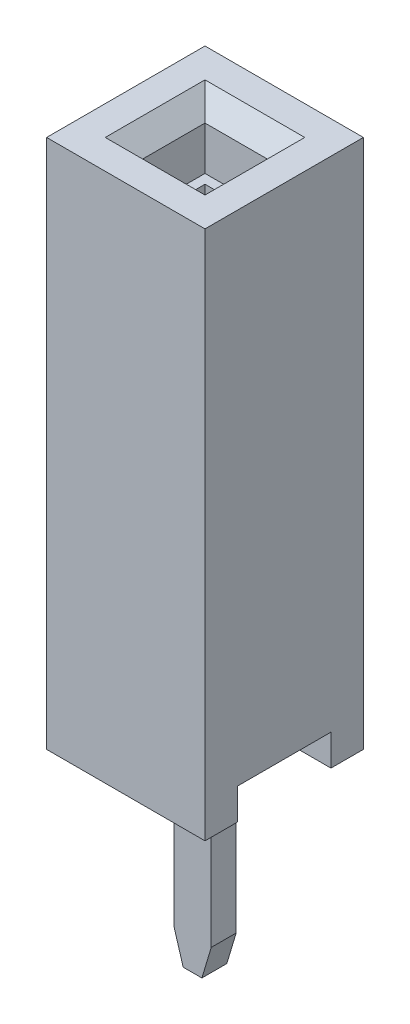
ISO-10303-21;
HEADER;
FILE_DESCRIPTION(('STEP AP214'),'2;1');
FILE_NAME('part.step','',(''),(''),'','','');
FILE_SCHEMA(('AUTOMOTIVE_DESIGN { 1 0 10303 214 1 1 1 1 }'));
ENDSEC;
DATA;
#1=APPLICATION_CONTEXT('core data for automotive mechanical design processes');
#2=APPLICATION_PROTOCOL_DEFINITION('international standard','automotive_design',2000,#1);
#3=PRODUCT_CONTEXT('',#1,'mechanical');
#4=PRODUCT('Part','Part','',(#3));
#5=PRODUCT_RELATED_PRODUCT_CATEGORY('part','',(#4));
#6=PRODUCT_DEFINITION_FORMATION('','',#4);
#7=PRODUCT_DEFINITION_CONTEXT('part definition',#1,'design');
#8=PRODUCT_DEFINITION('design','',#6,#7);
#9=PRODUCT_DEFINITION_SHAPE('','',#8);
#10=(LENGTH_UNIT() NAMED_UNIT(*) SI_UNIT(.MILLI.,.METRE.));
#11=(NAMED_UNIT(*) PLANE_ANGLE_UNIT() SI_UNIT($,.RADIAN.));
#12=(NAMED_UNIT(*) SI_UNIT($,.STERADIAN.) SOLID_ANGLE_UNIT());
#13=UNCERTAINTY_MEASURE_WITH_UNIT(LENGTH_MEASURE(1.E-05),#10,'distance_accuracy_value','');
#14=(GEOMETRIC_REPRESENTATION_CONTEXT(3) GLOBAL_UNCERTAINTY_ASSIGNED_CONTEXT((#13)) GLOBAL_UNIT_ASSIGNED_CONTEXT((#10,
#11,#12)) REPRESENTATION_CONTEXT('',''));
#15=CARTESIAN_POINT('',(0.,0.,0.));
#16=DIRECTION('',(0.,0.,1.));
#17=DIRECTION('',(1.,0.,0.));
#18=AXIS2_PLACEMENT_3D('',#15,#16,#17);
#19=CARTESIAN_POINT('',(-6.,0.,0.));
#20=DIRECTION('',(1.,0.,0.));
#21=DIRECTION('',(0.,0.,-1.));
#22=AXIS2_PLACEMENT_3D('',#19,#20,#21);
#23=PLANE('',#22);
#24=DIRECTION('',(0.,0.,-1.));
#25=VECTOR('',#24,1.);
#26=CARTESIAN_POINT('',(-6.,0.9,0.35));
#27=LINE('',#26,#25);
#28=CARTESIAN_POINT('',(-6.,0.9,-0.35));
#29=VERTEX_POINT('',#28);
#30=CARTESIAN_POINT('',(-6.,0.9,0.35));
#31=VERTEX_POINT('',#30);
#32=EDGE_CURVE('E435',#29,#31,#27,.F.);
#33=ORIENTED_EDGE('',*,*,#32,.T.);
#34=DIRECTION('',(0.,1.,0.));
#35=VECTOR('',#34,1.);
#36=CARTESIAN_POINT('',(-6.,7.5,0.35));
#37=LINE('',#36,#35);
#38=CARTESIAN_POINT('',(-6.,7.5,0.35));
#39=VERTEX_POINT('',#38);
#40=EDGE_CURVE('E437',#31,#39,#37,.T.);
#41=ORIENTED_EDGE('',*,*,#40,.T.);
#42=DIRECTION('',(0.,0.,-1.));
#43=VECTOR('',#42,1.);
#44=CARTESIAN_POINT('',(-6.,7.5,0.));
#45=LINE('',#44,#43);
#46=CARTESIAN_POINT('',(-6.,7.5,-0.35));
#47=VERTEX_POINT('',#46);
#48=EDGE_CURVE('E442',#47,#39,#45,.F.);
#49=ORIENTED_EDGE('',*,*,#48,.F.);
#50=DIRECTION('',(0.,1.,0.));
#51=VECTOR('',#50,1.);
#52=CARTESIAN_POINT('',(-6.,0.9,-0.35));
#53=LINE('',#52,#51);
#54=EDGE_CURVE('E429',#47,#29,#53,.F.);
#55=ORIENTED_EDGE('',*,*,#54,.T.);
#56=EDGE_LOOP('',(#33,#41,#49,#55));
#57=FACE_BOUND('',#56,.T.);
#58=ADVANCED_FACE('F17',(#57),#23,.F.);
#59=CARTESIAN_POINT('',(-6.7,7.5,0.35));
#60=DIRECTION('',(0.,0.,1.));
#61=DIRECTION('',(1.,0.,0.));
#62=AXIS2_PLACEMENT_3D('',#59,#60,#61);
#63=PLANE('',#62);
#64=DIRECTION('',(1.,0.,0.));
#65=VECTOR('',#64,1.);
#66=CARTESIAN_POINT('',(-6.7,0.9,0.35));
#67=LINE('',#66,#65);
#68=CARTESIAN_POINT('',(-6.7,0.9,0.35));
#69=VERTEX_POINT('',#68);
#70=EDGE_CURVE('E433',#31,#69,#67,.F.);
#71=ORIENTED_EDGE('',*,*,#70,.T.);
#72=DIRECTION('',(0.,1.,0.));
#73=VECTOR('',#72,1.);
#74=CARTESIAN_POINT('',(-6.7,0.,0.35));
#75=LINE('',#74,#73);
#76=CARTESIAN_POINT('',(-6.7,7.5,0.35));
#77=VERTEX_POINT('',#76);
#78=EDGE_CURVE('E418',#77,#69,#75,.F.);
#79=ORIENTED_EDGE('',*,*,#78,.F.);
#80=DIRECTION('',(1.,0.,0.));
#81=VECTOR('',#80,1.);
#82=CARTESIAN_POINT('',(-6.7,7.5,0.35));
#83=LINE('',#82,#81);
#84=EDGE_CURVE('E440',#39,#77,#83,.F.);
#85=ORIENTED_EDGE('',*,*,#84,.F.);
#86=ORIENTED_EDGE('',*,*,#40,.F.);
#87=EDGE_LOOP('',(#71,#79,#85,#86));
#88=FACE_BOUND('',#87,.T.);
#89=ADVANCED_FACE('F626',(#88),#63,.F.);
#90=CARTESIAN_POINT('',(-6.7,0.9,0.35));
#91=DIRECTION('',(0.,-1.,0.));
#92=DIRECTION('',(0.,0.,-1.));
#93=AXIS2_PLACEMENT_3D('',#90,#91,#92);
#94=PLANE('',#93);
#95=ORIENTED_EDGE('',*,*,#32,.F.);
#96=DIRECTION('',(-1.,0.,0.));
#97=VECTOR('',#96,1.);
#98=CARTESIAN_POINT('',(-6.7,0.9,-0.35));
#99=LINE('',#98,#97);
#100=CARTESIAN_POINT('',(-6.7,0.9,-0.35));
#101=VERTEX_POINT('',#100);
#102=EDGE_CURVE('E427',#29,#101,#99,.T.);
#103=ORIENTED_EDGE('',*,*,#102,.T.);
#104=DIRECTION('',(0.,0.,-1.));
#105=VECTOR('',#104,1.);
#106=CARTESIAN_POINT('',(-6.7,0.9,0.));
#107=LINE('',#106,#105);
#108=EDGE_CURVE('E415',#69,#101,#107,.T.);
#109=ORIENTED_EDGE('',*,*,#108,.F.);
#110=ORIENTED_EDGE('',*,*,#70,.F.);
#111=EDGE_LOOP('',(#95,#103,#109,#110));
#112=FACE_BOUND('',#111,.T.);
#113=ADVANCED_FACE('F620',(#112),#94,.F.);
#114=CARTESIAN_POINT('',(-6.7,0.9,-0.35));
#115=DIRECTION('',(0.,0.,-1.));
#116=DIRECTION('',(-1.,0.,0.));
#117=AXIS2_PLACEMENT_3D('',#114,#115,#116);
#118=PLANE('',#117);
#119=ORIENTED_EDGE('',*,*,#102,.F.);
#120=ORIENTED_EDGE('',*,*,#54,.F.);
#121=DIRECTION('',(-1.,0.,0.));
#122=VECTOR('',#121,1.);
#123=CARTESIAN_POINT('',(-6.7,7.5,-0.35));
#124=LINE('',#123,#122);
#125=CARTESIAN_POINT('',(-6.7,7.5,-0.35));
#126=VERTEX_POINT('',#125);
#127=EDGE_CURVE('E431',#126,#47,#124,.F.);
#128=ORIENTED_EDGE('',*,*,#127,.F.);
#129=DIRECTION('',(0.,1.,0.));
#130=VECTOR('',#129,1.);
#131=CARTESIAN_POINT('',(-6.7,0.,-0.35));
#132=LINE('',#131,#130);
#133=EDGE_CURVE('E412',#101,#126,#132,.T.);
#134=ORIENTED_EDGE('',*,*,#133,.F.);
#135=EDGE_LOOP('',(#119,#120,#128,#134));
#136=FACE_BOUND('',#135,.T.);
#137=ADVANCED_FACE('F613',(#136),#118,.F.);
#138=CARTESIAN_POINT('',(-6.65,-3.,0.2));
#139=DIRECTION('',(0.,-1.,0.));
#140=DIRECTION('',(0.,0.,-1.));
#141=AXIS2_PLACEMENT_3D('',#138,#139,#140);
#142=PLANE('',#141);
#143=DIRECTION('',(1.,0.,0.));
#144=VECTOR('',#143,1.);
#145=CARTESIAN_POINT('',(-6.65,-3.,0.2));
#146=LINE('',#145,#144);
#147=CARTESIAN_POINT('',(-6.5,-3.,0.2));
#148=VERTEX_POINT('',#147);
#149=CARTESIAN_POINT('',(-6.2,-3.,0.2));
#150=VERTEX_POINT('',#149);
#151=EDGE_CURVE('E391',#148,#150,#146,.T.);
#152=ORIENTED_EDGE('',*,*,#151,.F.);
#153=DIRECTION('',(0.,0.,1.));
#154=VECTOR('',#153,1.);
#155=CARTESIAN_POINT('',(-6.5,-3.,0.));
#156=LINE('',#155,#154);
#157=CARTESIAN_POINT('',(-6.5,-3.,-0.2));
#158=VERTEX_POINT('',#157);
#159=EDGE_CURVE('E409',#158,#148,#156,.T.);
#160=ORIENTED_EDGE('',*,*,#159,.F.);
#161=DIRECTION('',(-1.,0.,0.));
#162=VECTOR('',#161,1.);
#163=CARTESIAN_POINT('',(-6.65,-3.,-0.2));
#164=LINE('',#163,#162);
#165=CARTESIAN_POINT('',(-6.2,-3.,-0.2));
#166=VERTEX_POINT('',#165);
#167=EDGE_CURVE('E397',#166,#158,#164,.T.);
#168=ORIENTED_EDGE('',*,*,#167,.F.);
#169=DIRECTION('',(0.,0.,1.));
#170=VECTOR('',#169,1.);
#171=CARTESIAN_POINT('',(-6.2,-3.,0.));
#172=LINE('',#171,#170);
#173=EDGE_CURVE('E425',#150,#166,#172,.F.);
#174=ORIENTED_EDGE('',*,*,#173,.F.);
#175=EDGE_LOOP('',(#152,#160,#168,#174));
#176=FACE_BOUND('',#175,.T.);
#177=ADVANCED_FACE('F611',(#176),#142,.T.);
#178=CARTESIAN_POINT('',(-6.125,-2.75,0.));
#179=DIRECTION('',(0.957826285221168,-0.287347885566291,0.));
#180=DIRECTION('',(0.287347885566291,0.957826285221168,0.));
#181=AXIS2_PLACEMENT_3D('',#178,#179,#180);
#182=PLANE('',#181);
#183=ORIENTED_EDGE('',*,*,#173,.T.);
#184=DIRECTION('',(-0.287347885566347,-0.957826285221151,0.));
#185=VECTOR('',#184,1.);
#186=CARTESIAN_POINT('',(-6.05,-2.5,-0.2));
#187=LINE('',#186,#185);
#188=CARTESIAN_POINT('',(-6.05,-2.5,-0.2));
#189=VERTEX_POINT('',#188);
#190=EDGE_CURVE('E400',#189,#166,#187,.T.);
#191=ORIENTED_EDGE('',*,*,#190,.F.);
#192=DIRECTION('',(0.,0.,-1.));
#193=VECTOR('',#192,1.);
#194=CARTESIAN_POINT('',(-6.05,-2.5,0.));
#195=LINE('',#194,#193);
#196=CARTESIAN_POINT('',(-6.05,-2.5,0.2));
#197=VERTEX_POINT('',#196);
#198=EDGE_CURVE('E421',#197,#189,#195,.T.);
#199=ORIENTED_EDGE('',*,*,#198,.F.);
#200=DIRECTION('',(0.287347885566347,0.957826285221151,0.));
#201=VECTOR('',#200,1.);
#202=CARTESIAN_POINT('',(-6.2,-3.,0.2));
#203=LINE('',#202,#201);
#204=EDGE_CURVE('E388',#150,#197,#203,.T.);
#205=ORIENTED_EDGE('',*,*,#204,.F.);
#206=EDGE_LOOP('',(#183,#191,#199,#205));
#207=FACE_BOUND('',#206,.T.);
#208=ADVANCED_FACE('F609',(#207),#182,.T.);
#209=CARTESIAN_POINT('',(-6.05,0.,0.));
#210=DIRECTION('',(1.,0.,0.));
#211=DIRECTION('',(0.,0.,-1.));
#212=AXIS2_PLACEMENT_3D('',#209,#210,#211);
#213=PLANE('',#212);
#214=DIRECTION('',(0.,1.,0.));
#215=VECTOR('',#214,1.);
#216=CARTESIAN_POINT('',(-6.05,0.5,0.2));
#217=LINE('',#216,#215);
#218=CARTESIAN_POINT('',(-6.05,0.5,0.2));
#219=VERTEX_POINT('',#218);
#220=EDGE_CURVE('E385',#197,#219,#217,.T.);
#221=ORIENTED_EDGE('',*,*,#220,.F.);
#222=ORIENTED_EDGE('',*,*,#198,.T.);
#223=DIRECTION('',(0.,1.,0.));
#224=VECTOR('',#223,1.);
#225=CARTESIAN_POINT('',(-6.05,-3.,-0.2));
#226=LINE('',#225,#224);
#227=CARTESIAN_POINT('',(-6.05,0.5,-0.2));
#228=VERTEX_POINT('',#227);
#229=EDGE_CURVE('E403',#228,#189,#226,.F.);
#230=ORIENTED_EDGE('',*,*,#229,.F.);
#231=DIRECTION('',(0.,0.,-1.));
#232=VECTOR('',#231,1.);
#233=CARTESIAN_POINT('',(-6.05,0.5,0.));
#234=LINE('',#233,#232);
#235=EDGE_CURVE('E423',#228,#219,#234,.F.);
#236=ORIENTED_EDGE('',*,*,#235,.T.);
#237=EDGE_LOOP('',(#221,#222,#230,#236));
#238=FACE_BOUND('',#237,.T.);
#239=ADVANCED_FACE('F606',(#238),#213,.T.);
#240=CARTESIAN_POINT('',(-6.7,0.,0.));
#241=DIRECTION('',(1.,0.,0.));
#242=DIRECTION('',(0.,0.,-1.));
#243=AXIS2_PLACEMENT_3D('',#240,#241,#242);
#244=PLANE('',#243);
#245=ORIENTED_EDGE('',*,*,#133,.T.);
#246=DIRECTION('',(0.,0.,1.));
#247=VECTOR('',#246,1.);
#248=CARTESIAN_POINT('',(-6.7,7.5,-0.75));
#249=LINE('',#248,#247);
#250=EDGE_CURVE('E377',#77,#126,#249,.F.);
#251=ORIENTED_EDGE('',*,*,#250,.F.);
#252=ORIENTED_EDGE('',*,*,#78,.T.);
#253=ORIENTED_EDGE('',*,*,#108,.T.);
#254=EDGE_LOOP('',(#245,#251,#252,#253));
#255=FACE_BOUND('',#254,.T.);
#256=ADVANCED_FACE('F644',(#255),#244,.T.);
#257=CARTESIAN_POINT('',(-6.575,-2.75,0.));
#258=DIRECTION('',(-0.957826285221168,-0.287347885566291,0.));
#259=DIRECTION('',(0.287347885566291,-0.957826285221168,0.));
#260=AXIS2_PLACEMENT_3D('',#257,#258,#259);
#261=PLANE('',#260);
#262=ORIENTED_EDGE('',*,*,#159,.T.);
#263=DIRECTION('',(0.287347885566346,-0.957826285221151,0.));
#264=VECTOR('',#263,1.);
#265=CARTESIAN_POINT('',(-6.65,-2.5,0.2));
#266=LINE('',#265,#264);
#267=CARTESIAN_POINT('',(-6.65,-2.5,0.2));
#268=VERTEX_POINT('',#267);
#269=EDGE_CURVE('E380',#268,#148,#266,.T.);
#270=ORIENTED_EDGE('',*,*,#269,.F.);
#271=DIRECTION('',(0.,0.,-1.));
#272=VECTOR('',#271,1.);
#273=CARTESIAN_POINT('',(-6.65,-2.5,0.));
#274=LINE('',#273,#272);
#275=CARTESIAN_POINT('',(-6.65,-2.5,-0.2));
#276=VERTEX_POINT('',#275);
#277=EDGE_CURVE('E373',#268,#276,#274,.T.);
#278=ORIENTED_EDGE('',*,*,#277,.T.);
#279=DIRECTION('',(-0.287347885566346,0.957826285221151,0.));
#280=VECTOR('',#279,1.);
#281=CARTESIAN_POINT('',(-6.5,-3.,-0.2));
#282=LINE('',#281,#280);
#283=EDGE_CURVE('E394',#158,#276,#282,.T.);
#284=ORIENTED_EDGE('',*,*,#283,.F.);
#285=EDGE_LOOP('',(#262,#270,#278,#284));
#286=FACE_BOUND('',#285,.T.);
#287=ADVANCED_FACE('F602',(#286),#261,.T.);
#288=CARTESIAN_POINT('',(-6.65,-3.,-0.2));
#289=DIRECTION('',(0.,0.,-1.));
#290=DIRECTION('',(-1.,0.,0.));
#291=AXIS2_PLACEMENT_3D('',#288,#289,#290);
#292=PLANE('',#291);
#293=ORIENTED_EDGE('',*,*,#167,.T.);
#294=ORIENTED_EDGE('',*,*,#283,.T.);
#295=DIRECTION('',(0.,1.,0.));
#296=VECTOR('',#295,1.);
#297=CARTESIAN_POINT('',(-6.65,0.,-0.2));
#298=LINE('',#297,#296);
#299=CARTESIAN_POINT('',(-6.65,0.5,-0.2));
#300=VERTEX_POINT('',#299);
#301=EDGE_CURVE('E370',#276,#300,#298,.T.);
#302=ORIENTED_EDGE('',*,*,#301,.T.);
#303=DIRECTION('',(-1.,0.,0.));
#304=VECTOR('',#303,1.);
#305=CARTESIAN_POINT('',(-6.65,0.5,-0.2));
#306=LINE('',#305,#304);
#307=EDGE_CURVE('E406',#300,#228,#306,.F.);
#308=ORIENTED_EDGE('',*,*,#307,.T.);
#309=ORIENTED_EDGE('',*,*,#229,.T.);
#310=ORIENTED_EDGE('',*,*,#190,.T.);
#311=EDGE_LOOP('',(#293,#294,#302,#308,#309,#310));
#312=FACE_BOUND('',#311,.T.);
#313=ADVANCED_FACE('F506',(#312),#292,.T.);
#314=CARTESIAN_POINT('',(-6.65,0.5,0.2));
#315=DIRECTION('',(0.,0.,1.));
#316=DIRECTION('',(1.,0.,0.));
#317=AXIS2_PLACEMENT_3D('',#314,#315,#316);
#318=PLANE('',#317);
#319=DIRECTION('',(0.,1.,0.));
#320=VECTOR('',#319,1.);
#321=CARTESIAN_POINT('',(-6.65,0.,0.2));
#322=LINE('',#321,#320);
#323=CARTESIAN_POINT('',(-6.65,0.5,0.2));
#324=VERTEX_POINT('',#323);
#325=EDGE_CURVE('E367',#324,#268,#322,.F.);
#326=ORIENTED_EDGE('',*,*,#325,.T.);
#327=ORIENTED_EDGE('',*,*,#269,.T.);
#328=ORIENTED_EDGE('',*,*,#151,.T.);
#329=ORIENTED_EDGE('',*,*,#204,.T.);
#330=ORIENTED_EDGE('',*,*,#220,.T.);
#331=DIRECTION('',(1.,0.,0.));
#332=VECTOR('',#331,1.);
#333=CARTESIAN_POINT('',(-6.65,0.5,0.2));
#334=LINE('',#333,#332);
#335=EDGE_CURVE('E383',#219,#324,#334,.F.);
#336=ORIENTED_EDGE('',*,*,#335,.T.);
#337=EDGE_LOOP('',(#326,#327,#328,#329,#330,#336));
#338=FACE_BOUND('',#337,.T.);
#339=ADVANCED_FACE('F495',(#338),#318,.T.);
#340=CARTESIAN_POINT('',(-7.075,7.5,-0.75));
#341=DIRECTION('',(0.,1.,0.));
#342=DIRECTION('',(0.,0.,1.));
#343=AXIS2_PLACEMENT_3D('',#340,#341,#342);
#344=PLANE('',#343);
#345=ORIENTED_EDGE('',*,*,#84,.T.);
#346=ORIENTED_EDGE('',*,*,#250,.T.);
#347=ORIENTED_EDGE('',*,*,#127,.T.);
#348=ORIENTED_EDGE('',*,*,#48,.T.);
#349=EDGE_LOOP('',(#345,#346,#347,#348));
#350=FACE_BOUND('',#349,.T.);
#351=DIRECTION('',(-1.,0.,0.));
#352=VECTOR('',#351,1.);
#353=CARTESIAN_POINT('',(-6.85,7.5,-0.5));
#354=LINE('',#353,#352);
#355=CARTESIAN_POINT('',(-5.85,7.5,-0.5));
#356=VERTEX_POINT('',#355);
#357=CARTESIAN_POINT('',(-6.85,7.5,-0.5));
#358=VERTEX_POINT('',#357);
#359=EDGE_CURVE('E348',#356,#358,#354,.T.);
#360=ORIENTED_EDGE('',*,*,#359,.T.);
#361=DIRECTION('',(0.,0.,-1.));
#362=VECTOR('',#361,1.);
#363=CARTESIAN_POINT('',(-6.85,7.5,0.));
#364=LINE('',#363,#362);
#365=CARTESIAN_POINT('',(-6.85,7.5,0.5));
#366=VERTEX_POINT('',#365);
#367=EDGE_CURVE('E350',#366,#358,#364,.T.);
#368=ORIENTED_EDGE('',*,*,#367,.F.);
#369=DIRECTION('',(1.,0.,0.));
#370=VECTOR('',#369,1.);
#371=CARTESIAN_POINT('',(-6.85,7.5,0.5));
#372=LINE('',#371,#370);
#373=CARTESIAN_POINT('',(-5.85,7.5,0.5));
#374=VERTEX_POINT('',#373);
#375=EDGE_CURVE('E356',#366,#374,#372,.T.);
#376=ORIENTED_EDGE('',*,*,#375,.T.);
#377=DIRECTION('',(0.,0.,-1.));
#378=VECTOR('',#377,1.);
#379=CARTESIAN_POINT('',(-5.85,7.5,0.));
#380=LINE('',#379,#378);
#381=EDGE_CURVE('E344',#374,#356,#380,.T.);
#382=ORIENTED_EDGE('',*,*,#381,.T.);
#383=EDGE_LOOP('',(#360,#368,#376,#382));
#384=FACE_BOUND('',#383,.T.);
#385=ADVANCED_FACE('F492',(#350,#384),#344,.T.);
#386=CARTESIAN_POINT('',(-7.1,7.5,-0.75));
#387=DIRECTION('',(0.,1.,0.));
#388=DIRECTION('',(0.,0.,1.));
#389=AXIS2_PLACEMENT_3D('',#386,#387,#388);
#390=PLANE('',#389);
#391=DIRECTION('',(0.,0.,-1.));
#392=VECTOR('',#391,1.);
#393=CARTESIAN_POINT('',(-7.1,7.5,0.));
#394=LINE('',#393,#392);
#395=CARTESIAN_POINT('',(-7.1,7.5,-0.75));
#396=VERTEX_POINT('',#395);
#397=CARTESIAN_POINT('',(-7.1,7.5,0.75));
#398=VERTEX_POINT('',#397);
#399=EDGE_CURVE('E336',#396,#398,#394,.F.);
#400=ORIENTED_EDGE('',*,*,#399,.F.);
#401=DIRECTION('',(1.,0.,0.));
#402=VECTOR('',#401,1.);
#403=CARTESIAN_POINT('',(-7.1,7.5,-0.75));
#404=LINE('',#403,#402);
#405=CARTESIAN_POINT('',(-7.075,7.5,-0.75));
#406=VERTEX_POINT('',#405);
#407=EDGE_CURVE('E375',#406,#396,#404,.F.);
#408=ORIENTED_EDGE('',*,*,#407,.F.);
#409=DIRECTION('',(0.,0.,-1.));
#410=VECTOR('',#409,1.);
#411=CARTESIAN_POINT('',(-7.075,7.5,0.));
#412=LINE('',#411,#410);
#413=CARTESIAN_POINT('',(-7.075,7.5,0.75));
#414=VERTEX_POINT('',#413);
#415=EDGE_CURVE('E326',#406,#414,#412,.F.);
#416=ORIENTED_EDGE('',*,*,#415,.T.);
#417=DIRECTION('',(1.,0.,0.));
#418=VECTOR('',#417,1.);
#419=CARTESIAN_POINT('',(-7.87,7.5,0.75));
#420=LINE('',#419,#418);
#421=EDGE_CURVE('E361',#414,#398,#420,.F.);
#422=ORIENTED_EDGE('',*,*,#421,.T.);
#423=EDGE_LOOP('',(#400,#408,#416,#422));
#424=FACE_BOUND('',#423,.T.);
#425=ADVANCED_FACE('F494',(#424),#390,.F.);
#426=CARTESIAN_POINT('',(-6.65,0.,0.));
#427=DIRECTION('',(1.,0.,0.));
#428=DIRECTION('',(0.,0.,-1.));
#429=AXIS2_PLACEMENT_3D('',#426,#427,#428);
#430=PLANE('',#429);
#431=DIRECTION('',(0.,0.,-1.));
#432=VECTOR('',#431,1.);
#433=CARTESIAN_POINT('',(-6.65,0.5,0.75));
#434=LINE('',#433,#432);
#435=EDGE_CURVE('E317',#300,#324,#434,.F.);
#436=ORIENTED_EDGE('',*,*,#435,.F.);
#437=ORIENTED_EDGE('',*,*,#301,.F.);
#438=ORIENTED_EDGE('',*,*,#277,.F.);
#439=ORIENTED_EDGE('',*,*,#325,.F.);
#440=EDGE_LOOP('',(#436,#437,#438,#439));
#441=FACE_BOUND('',#440,.T.);
#442=ADVANCED_FACE('F503',(#441),#430,.F.);
#443=CARTESIAN_POINT('',(-7.1,7.5,-0.75));
#444=DIRECTION('',(0.,1.,0.));
#445=DIRECTION('',(0.,0.,1.));
#446=AXIS2_PLACEMENT_3D('',#443,#444,#445);
#447=PLANE('',#446);
#448=DIRECTION('',(0.,0.,-1.));
#449=VECTOR('',#448,1.);
#450=CARTESIAN_POINT('',(-5.6,7.5,0.));
#451=LINE('',#450,#449);
#452=CARTESIAN_POINT('',(-5.6,7.5,-0.75));
#453=VERTEX_POINT('',#452);
#454=CARTESIAN_POINT('',(-5.6,7.5,0.75));
#455=VERTEX_POINT('',#454);
#456=EDGE_CURVE('E306',#453,#455,#451,.F.);
#457=ORIENTED_EDGE('',*,*,#456,.T.);
#458=DIRECTION('',(1.,0.,0.));
#459=VECTOR('',#458,1.);
#460=CARTESIAN_POINT('',(-7.87,7.5,0.75));
#461=LINE('',#460,#459);
#462=CARTESIAN_POINT('',(-5.625,7.5,0.75));
#463=VERTEX_POINT('',#462);
#464=EDGE_CURVE('E363',#455,#463,#461,.F.);
#465=ORIENTED_EDGE('',*,*,#464,.T.);
#466=DIRECTION('',(0.,0.,-1.));
#467=VECTOR('',#466,1.);
#468=CARTESIAN_POINT('',(-5.625,7.5,0.));
#469=LINE('',#468,#467);
#470=CARTESIAN_POINT('',(-5.625,7.5,-0.75));
#471=VERTEX_POINT('',#470);
#472=EDGE_CURVE('E311',#471,#463,#469,.F.);
#473=ORIENTED_EDGE('',*,*,#472,.F.);
#474=DIRECTION('',(1.,0.,0.));
#475=VECTOR('',#474,1.);
#476=CARTESIAN_POINT('',(-7.1,7.5,-0.75));
#477=LINE('',#476,#475);
#478=EDGE_CURVE('E365',#453,#471,#477,.F.);
#479=ORIENTED_EDGE('',*,*,#478,.F.);
#480=EDGE_LOOP('',(#457,#465,#473,#479));
#481=FACE_BOUND('',#480,.T.);
#482=ADVANCED_FACE('F582',(#481),#447,.F.);
#483=CARTESIAN_POINT('',(-7.87,0.,0.75));
#484=DIRECTION('',(0.,0.,1.));
#485=DIRECTION('',(1.,0.,0.));
#486=AXIS2_PLACEMENT_3D('',#483,#484,#485);
#487=PLANE('',#486);
#488=DIRECTION('',(1.,0.,0.));
#489=VECTOR('',#488,1.);
#490=CARTESIAN_POINT('',(-7.87,0.,0.75));
#491=LINE('',#490,#489);
#492=CARTESIAN_POINT('',(-7.62,0.,0.75));
#493=VERTEX_POINT('',#492);
#494=CARTESIAN_POINT('',(-5.08,0.,0.75));
#495=VERTEX_POINT('',#494);
#496=EDGE_CURVE('E296',#493,#495,#491,.T.);
#497=ORIENTED_EDGE('',*,*,#496,.F.);
#498=DIRECTION('',(0.,1.,0.));
#499=VECTOR('',#498,1.);
#500=CARTESIAN_POINT('',(-7.62,0.,0.75));
#501=LINE('',#500,#499);
#502=CARTESIAN_POINT('',(-7.62,0.5,0.75));
#503=VERTEX_POINT('',#502);
#504=EDGE_CURVE('E971',#493,#503,#501,.T.);
#505=ORIENTED_EDGE('',*,*,#504,.T.);
#506=DIRECTION('',(1.,0.,0.));
#507=VECTOR('',#506,1.);
#508=CARTESIAN_POINT('',(-7.87,0.5,0.75));
#509=LINE('',#508,#507);
#510=CARTESIAN_POINT('',(-7.1,0.5,0.75));
#511=VERTEX_POINT('',#510);
#512=EDGE_CURVE('E358',#511,#503,#509,.F.);
#513=ORIENTED_EDGE('',*,*,#512,.F.);
#514=DIRECTION('',(0.,1.,0.));
#515=VECTOR('',#514,1.);
#516=CARTESIAN_POINT('',(-7.1,0.,0.75));
#517=LINE('',#516,#515);
#518=EDGE_CURVE('E333',#398,#511,#517,.F.);
#519=ORIENTED_EDGE('',*,*,#518,.F.);
#520=ORIENTED_EDGE('',*,*,#421,.F.);
#521=DIRECTION('',(0.,1.,0.));
#522=VECTOR('',#521,1.);
#523=CARTESIAN_POINT('',(-7.075,0.,0.75));
#524=LINE('',#523,#522);
#525=CARTESIAN_POINT('',(-7.075,0.5,0.75));
#526=VERTEX_POINT('',#525);
#527=EDGE_CURVE('E329',#414,#526,#524,.F.);
#528=ORIENTED_EDGE('',*,*,#527,.T.);
#529=DIRECTION('',(1.,0.,0.));
#530=VECTOR('',#529,1.);
#531=CARTESIAN_POINT('',(-7.075,0.5,0.75));
#532=LINE('',#531,#530);
#533=CARTESIAN_POINT('',(-5.625,0.5,0.75));
#534=VERTEX_POINT('',#533);
#535=EDGE_CURVE('E320',#534,#526,#532,.F.);
#536=ORIENTED_EDGE('',*,*,#535,.F.);
#537=DIRECTION('',(0.,1.,0.));
#538=VECTOR('',#537,1.);
#539=CARTESIAN_POINT('',(-5.625,0.,0.75));
#540=LINE('',#539,#538);
#541=EDGE_CURVE('E308',#463,#534,#540,.F.);
#542=ORIENTED_EDGE('',*,*,#541,.F.);
#543=ORIENTED_EDGE('',*,*,#464,.F.);
#544=DIRECTION('',(0.,1.,0.));
#545=VECTOR('',#544,1.);
#546=CARTESIAN_POINT('',(-5.6,0.,0.75));
#547=LINE('',#546,#545);
#548=CARTESIAN_POINT('',(-5.6,0.5,0.75));
#549=VERTEX_POINT('',#548);
#550=EDGE_CURVE('E304',#455,#549,#547,.F.);
#551=ORIENTED_EDGE('',*,*,#550,.T.);
#552=DIRECTION('',(1.,0.,0.));
#553=VECTOR('',#552,1.);
#554=CARTESIAN_POINT('',(-7.87,0.5,0.75));
#555=LINE('',#554,#553);
#556=CARTESIAN_POINT('',(-5.08,0.5,0.75));
#557=VERTEX_POINT('',#556);
#558=EDGE_CURVE('E298',#549,#557,#555,.T.);
#559=ORIENTED_EDGE('',*,*,#558,.T.);
#560=DIRECTION('',(0.,-1.,0.));
#561=VECTOR('',#560,1.);
#562=CARTESIAN_POINT('',(-5.08,0.,0.75));
#563=LINE('',#562,#561);
#564=EDGE_CURVE('E958',#557,#495,#563,.T.);
#565=ORIENTED_EDGE('',*,*,#564,.T.);
#566=EDGE_LOOP('',(#497,#505,#513,#519,#520,#528,#536,#542,#543,#551,#559,#565));
#567=FACE_BOUND('',#566,.T.);
#568=ADVANCED_FACE('F579',(#567),#487,.F.);
#569=CARTESIAN_POINT('',(-6.85,8.5,0.5));
#570=DIRECTION('',(0.,0.,1.));
#571=DIRECTION('',(1.,0.,0.));
#572=AXIS2_PLACEMENT_3D('',#569,#570,#571);
#573=PLANE('',#572);
#574=DIRECTION('',(1.,0.,0.));
#575=VECTOR('',#574,1.);
#576=CARTESIAN_POINT('',(-6.35,8.2,0.5));
#577=LINE('',#576,#575);
#578=CARTESIAN_POINT('',(-5.85,8.2,0.5));
#579=VERTEX_POINT('',#578);
#580=CARTESIAN_POINT('',(-6.85,8.2,0.5));
#581=VERTEX_POINT('',#580);
#582=EDGE_CURVE('E293',#579,#581,#577,.F.);
#583=ORIENTED_EDGE('',*,*,#582,.F.);
#584=DIRECTION('',(0.,1.,0.));
#585=VECTOR('',#584,1.);
#586=CARTESIAN_POINT('',(-5.85,0.,0.5));
#587=LINE('',#586,#585);
#588=EDGE_CURVE('E339',#579,#374,#587,.F.);
#589=ORIENTED_EDGE('',*,*,#588,.T.);
#590=ORIENTED_EDGE('',*,*,#375,.F.);
#591=DIRECTION('',(0.,1.,0.));
#592=VECTOR('',#591,1.);
#593=CARTESIAN_POINT('',(-6.85,0.,0.5));
#594=LINE('',#593,#592);
#595=EDGE_CURVE('E353',#581,#366,#594,.F.);
#596=ORIENTED_EDGE('',*,*,#595,.F.);
#597=EDGE_LOOP('',(#583,#589,#590,#596));
#598=FACE_BOUND('',#597,.T.);
#599=ADVANCED_FACE('F483',(#598),#573,.F.);
#600=CARTESIAN_POINT('',(-6.85,0.,0.));
#601=DIRECTION('',(1.,0.,0.));
#602=DIRECTION('',(0.,0.,-1.));
#603=AXIS2_PLACEMENT_3D('',#600,#601,#602);
#604=PLANE('',#603);
#605=ORIENTED_EDGE('',*,*,#595,.T.);
#606=ORIENTED_EDGE('',*,*,#367,.T.);
#607=DIRECTION('',(0.,1.,0.));
#608=VECTOR('',#607,1.);
#609=CARTESIAN_POINT('',(-6.85,0.5,-0.5));
#610=LINE('',#609,#608);
#611=CARTESIAN_POINT('',(-6.85,8.2,-0.5));
#612=VERTEX_POINT('',#611);
#613=EDGE_CURVE('E346',#358,#612,#610,.T.);
#614=ORIENTED_EDGE('',*,*,#613,.T.);
#615=DIRECTION('',(0.,0.,1.));
#616=VECTOR('',#615,1.);
#617=CARTESIAN_POINT('',(-6.85,8.2,0.));
#618=LINE('',#617,#616);
#619=EDGE_CURVE('E287',#581,#612,#618,.F.);
#620=ORIENTED_EDGE('',*,*,#619,.F.);
#621=EDGE_LOOP('',(#605,#606,#614,#620));
#622=FACE_BOUND('',#621,.T.);
#623=ADVANCED_FACE('F486',(#622),#604,.T.);
#624=CARTESIAN_POINT('',(-6.85,0.5,-0.5));
#625=DIRECTION('',(0.,0.,-1.));
#626=DIRECTION('',(-1.,0.,0.));
#627=AXIS2_PLACEMENT_3D('',#624,#625,#626);
#628=PLANE('',#627);
#629=DIRECTION('',(1.,0.,0.));
#630=VECTOR('',#629,1.);
#631=CARTESIAN_POINT('',(-6.35,8.2,-0.5));
#632=LINE('',#631,#630);
#633=CARTESIAN_POINT('',(-5.85,8.2,-0.5));
#634=VERTEX_POINT('',#633);
#635=EDGE_CURVE('E281',#612,#634,#632,.T.);
#636=ORIENTED_EDGE('',*,*,#635,.F.);
#637=ORIENTED_EDGE('',*,*,#613,.F.);
#638=ORIENTED_EDGE('',*,*,#359,.F.);
#639=DIRECTION('',(0.,1.,0.));
#640=VECTOR('',#639,1.);
#641=CARTESIAN_POINT('',(-5.85,0.,-0.5));
#642=LINE('',#641,#640);
#643=EDGE_CURVE('E342',#356,#634,#642,.T.);
#644=ORIENTED_EDGE('',*,*,#643,.T.);
#645=EDGE_LOOP('',(#636,#637,#638,#644));
#646=FACE_BOUND('',#645,.T.);
#647=ADVANCED_FACE('F490',(#646),#628,.F.);
#648=CARTESIAN_POINT('',(-5.85,0.,0.));
#649=DIRECTION('',(1.,0.,0.));
#650=DIRECTION('',(0.,0.,-1.));
#651=AXIS2_PLACEMENT_3D('',#648,#649,#650);
#652=PLANE('',#651);
#653=DIRECTION('',(0.,0.,1.));
#654=VECTOR('',#653,1.);
#655=CARTESIAN_POINT('',(-5.85,8.2,0.));
#656=LINE('',#655,#654);
#657=EDGE_CURVE('E272',#634,#579,#656,.T.);
#658=ORIENTED_EDGE('',*,*,#657,.F.);
#659=ORIENTED_EDGE('',*,*,#643,.F.);
#660=ORIENTED_EDGE('',*,*,#381,.F.);
#661=ORIENTED_EDGE('',*,*,#588,.F.);
#662=EDGE_LOOP('',(#658,#659,#660,#661));
#663=FACE_BOUND('',#662,.T.);
#664=ADVANCED_FACE('F480',(#663),#652,.F.);
#665=CARTESIAN_POINT('',(-7.1,0.,0.));
#666=DIRECTION('',(1.,0.,0.));
#667=DIRECTION('',(0.,0.,-1.));
#668=AXIS2_PLACEMENT_3D('',#665,#666,#667);
#669=PLANE('',#668);
#670=ORIENTED_EDGE('',*,*,#518,.T.);
#671=DIRECTION('',(0.,0.,-1.));
#672=VECTOR('',#671,1.);
#673=CARTESIAN_POINT('',(-7.1,0.5,0.));
#674=LINE('',#673,#672);
#675=CARTESIAN_POINT('',(-7.1,0.5,-0.75));
#676=VERTEX_POINT('',#675);
#677=EDGE_CURVE('E331',#511,#676,#674,.T.);
#678=ORIENTED_EDGE('',*,*,#677,.T.);
#679=DIRECTION('',(0.,1.,0.));
#680=VECTOR('',#679,1.);
#681=CARTESIAN_POINT('',(-7.1,0.5,-0.75));
#682=LINE('',#681,#680);
#683=EDGE_CURVE('E269',#676,#396,#682,.T.);
#684=ORIENTED_EDGE('',*,*,#683,.T.);
#685=ORIENTED_EDGE('',*,*,#399,.T.);
#686=EDGE_LOOP('',(#670,#678,#684,#685));
#687=FACE_BOUND('',#686,.T.);
#688=ADVANCED_FACE('F566',(#687),#669,.T.);
#689=CARTESIAN_POINT('',(-7.075,0.,0.));
#690=DIRECTION('',(1.,0.,0.));
#691=DIRECTION('',(0.,0.,-1.));
#692=AXIS2_PLACEMENT_3D('',#689,#690,#691);
#693=PLANE('',#692);
#694=DIRECTION('',(0.,1.,0.));
#695=VECTOR('',#694,1.);
#696=CARTESIAN_POINT('',(-7.075,0.5,-0.75));
#697=LINE('',#696,#695);
#698=CARTESIAN_POINT('',(-7.075,0.5,-0.75));
#699=VERTEX_POINT('',#698);
#700=EDGE_CURVE('E267',#406,#699,#697,.F.);
#701=ORIENTED_EDGE('',*,*,#700,.T.);
#702=DIRECTION('',(0.,0.,-1.));
#703=VECTOR('',#702,1.);
#704=CARTESIAN_POINT('',(-7.075,0.5,0.75));
#705=LINE('',#704,#703);
#706=EDGE_CURVE('E323',#526,#699,#705,.T.);
#707=ORIENTED_EDGE('',*,*,#706,.F.);
#708=ORIENTED_EDGE('',*,*,#527,.F.);
#709=ORIENTED_EDGE('',*,*,#415,.F.);
#710=EDGE_LOOP('',(#701,#707,#708,#709));
#711=FACE_BOUND('',#710,.T.);
#712=ADVANCED_FACE('F562',(#711),#693,.F.);
#713=CARTESIAN_POINT('',(-7.075,0.5,0.75));
#714=DIRECTION('',(0.,-1.,0.));
#715=DIRECTION('',(0.,0.,-1.));
#716=AXIS2_PLACEMENT_3D('',#713,#714,#715);
#717=PLANE('',#716);
#718=ORIENTED_EDGE('',*,*,#307,.F.);
#719=ORIENTED_EDGE('',*,*,#435,.T.);
#720=ORIENTED_EDGE('',*,*,#335,.F.);
#721=ORIENTED_EDGE('',*,*,#235,.F.);
#722=EDGE_LOOP('',(#718,#719,#720,#721));
#723=FACE_BOUND('',#722,.T.);
#724=DIRECTION('',(0.,0.,-1.));
#725=VECTOR('',#724,1.);
#726=CARTESIAN_POINT('',(-5.625,0.5,0.));
#727=LINE('',#726,#725);
#728=CARTESIAN_POINT('',(-5.625,0.5,-0.75));
#729=VERTEX_POINT('',#728);
#730=EDGE_CURVE('E314',#534,#729,#727,.T.);
#731=ORIENTED_EDGE('',*,*,#730,.F.);
#732=ORIENTED_EDGE('',*,*,#535,.T.);
#733=ORIENTED_EDGE('',*,*,#706,.T.);
#734=DIRECTION('',(-1.,0.,0.));
#735=VECTOR('',#734,1.);
#736=CARTESIAN_POINT('',(-7.87,0.5,-0.75));
#737=LINE('',#736,#735);
#738=EDGE_CURVE('E265',#699,#729,#737,.F.);
#739=ORIENTED_EDGE('',*,*,#738,.T.);
#740=EDGE_LOOP('',(#731,#732,#733,#739));
#741=FACE_BOUND('',#740,.T.);
#742=ADVANCED_FACE('F558',(#723,#741),#717,.T.);
#743=CARTESIAN_POINT('',(-5.625,0.,0.));
#744=DIRECTION('',(1.,0.,0.));
#745=DIRECTION('',(0.,0.,-1.));
#746=AXIS2_PLACEMENT_3D('',#743,#744,#745);
#747=PLANE('',#746);
#748=ORIENTED_EDGE('',*,*,#472,.T.);
#749=ORIENTED_EDGE('',*,*,#541,.T.);
#750=ORIENTED_EDGE('',*,*,#730,.T.);
#751=DIRECTION('',(0.,1.,0.));
#752=VECTOR('',#751,1.);
#753=CARTESIAN_POINT('',(-5.625,0.5,-0.75));
#754=LINE('',#753,#752);
#755=EDGE_CURVE('E262',#729,#471,#754,.T.);
#756=ORIENTED_EDGE('',*,*,#755,.T.);
#757=EDGE_LOOP('',(#748,#749,#750,#756));
#758=FACE_BOUND('',#757,.T.);
#759=ADVANCED_FACE('F554',(#758),#747,.T.);
#760=CARTESIAN_POINT('',(-5.6,0.,0.));
#761=DIRECTION('',(1.,0.,0.));
#762=DIRECTION('',(0.,0.,-1.));
#763=AXIS2_PLACEMENT_3D('',#760,#761,#762);
#764=PLANE('',#763);
#765=ORIENTED_EDGE('',*,*,#456,.F.);
#766=DIRECTION('',(0.,1.,0.));
#767=VECTOR('',#766,1.);
#768=CARTESIAN_POINT('',(-5.6,0.5,-0.75));
#769=LINE('',#768,#767);
#770=CARTESIAN_POINT('',(-5.6,0.5,-0.75));
#771=VERTEX_POINT('',#770);
#772=EDGE_CURVE('E260',#453,#771,#769,.F.);
#773=ORIENTED_EDGE('',*,*,#772,.T.);
#774=DIRECTION('',(0.,0.,1.));
#775=VECTOR('',#774,1.);
#776=CARTESIAN_POINT('',(-5.6,0.5,0.75));
#777=LINE('',#776,#775);
#778=EDGE_CURVE('E301',#771,#549,#777,.T.);
#779=ORIENTED_EDGE('',*,*,#778,.T.);
#780=ORIENTED_EDGE('',*,*,#550,.F.);
#781=EDGE_LOOP('',(#765,#773,#779,#780));
#782=FACE_BOUND('',#781,.T.);
#783=ADVANCED_FACE('F550',(#782),#764,.F.);
#784=CARTESIAN_POINT('',(-7.87,0.5,0.75));
#785=DIRECTION('',(0.,1.,0.));
#786=DIRECTION('',(0.,0.,1.));
#787=AXIS2_PLACEMENT_3D('',#784,#785,#786);
#788=PLANE('',#787);
#789=DIRECTION('',(-1.,0.,0.));
#790=VECTOR('',#789,1.);
#791=CARTESIAN_POINT('',(-7.87,0.5,-0.75));
#792=LINE('',#791,#790);
#793=CARTESIAN_POINT('',(-5.08,0.5,-0.75));
#794=VERTEX_POINT('',#793);
#795=EDGE_CURVE('E257',#771,#794,#792,.F.);
#796=ORIENTED_EDGE('',*,*,#795,.T.);
#797=DIRECTION('',(0.,0.,1.));
#798=VECTOR('',#797,1.);
#799=CARTESIAN_POINT('',(-5.08,0.5,0.75));
#800=LINE('',#799,#798);
#801=EDGE_CURVE('E960',#794,#557,#800,.T.);
#802=ORIENTED_EDGE('',*,*,#801,.T.);
#803=ORIENTED_EDGE('',*,*,#558,.F.);
#804=ORIENTED_EDGE('',*,*,#778,.F.);
#805=EDGE_LOOP('',(#796,#802,#803,#804));
#806=FACE_BOUND('',#805,.T.);
#807=ADVANCED_FACE('F546',(#806),#788,.F.);
#808=CARTESIAN_POINT('',(-7.87,0.,1.27));
#809=DIRECTION('',(0.,-1.,0.));
#810=DIRECTION('',(0.,0.,-1.));
#811=AXIS2_PLACEMENT_3D('',#808,#809,#810);
#812=PLANE('',#811);
#813=DIRECTION('',(0.,0.,1.));
#814=VECTOR('',#813,1.);
#815=CARTESIAN_POINT('',(-7.62,0.,1.27));
#816=LINE('',#815,#814);
#817=CARTESIAN_POINT('',(-7.62,0.,1.27));
#818=VERTEX_POINT('',#817);
#819=EDGE_CURVE('E226',#493,#818,#816,.T.);
#820=ORIENTED_EDGE('',*,*,#819,.F.);
#821=ORIENTED_EDGE('',*,*,#496,.T.);
#822=DIRECTION('',(0.,0.,-1.));
#823=VECTOR('',#822,1.);
#824=CARTESIAN_POINT('',(-5.08,0.,1.27));
#825=LINE('',#824,#823);
#826=CARTESIAN_POINT('',(-5.08,0.,1.27));
#827=VERTEX_POINT('',#826);
#828=EDGE_CURVE('E443',#827,#495,#825,.T.);
#829=ORIENTED_EDGE('',*,*,#828,.F.);
#830=DIRECTION('',(1.,0.,0.));
#831=VECTOR('',#830,1.);
#832=CARTESIAN_POINT('',(-7.87,0.,1.27));
#833=LINE('',#832,#831);
#834=EDGE_CURVE('E246',#818,#827,#833,.T.);
#835=ORIENTED_EDGE('',*,*,#834,.F.);
#836=EDGE_LOOP('',(#820,#821,#829,#835));
#837=FACE_BOUND('',#836,.T.);
#838=ADVANCED_FACE('F543',(#837),#812,.T.);
#839=CARTESIAN_POINT('',(-6.35,8.35,0.65));
#840=DIRECTION('',(0.,0.707106781186548,-0.707106781186548));
#841=DIRECTION('',(0.,0.707106781186548,0.707106781186548));
#842=AXIS2_PLACEMENT_3D('',#839,#840,#841);
#843=PLANE('',#842);
#844=DIRECTION('',(0.577350269189624,-0.577350269189628,-0.577350269189625));
#845=VECTOR('',#844,1.);
#846=CARTESIAN_POINT('',(-7.15,8.5,0.8));
#847=LINE('',#846,#845);
#848=CARTESIAN_POINT('',(-7.15,8.5,0.8));
#849=VERTEX_POINT('',#848);
#850=EDGE_CURVE('E290',#849,#581,#847,.T.);
#851=ORIENTED_EDGE('',*,*,#850,.F.);
#852=DIRECTION('',(1.,0.,0.));
#853=VECTOR('',#852,1.);
#854=CARTESIAN_POINT('',(-7.87,8.5,0.8));
#855=LINE('',#854,#853);
#856=CARTESIAN_POINT('',(-5.55,8.5,0.8));
#857=VERTEX_POINT('',#856);
#858=EDGE_CURVE('E245',#857,#849,#855,.F.);
#859=ORIENTED_EDGE('',*,*,#858,.F.);
#860=DIRECTION('',(0.577350269189627,0.577350269189627,0.577350269189624));
#861=VECTOR('',#860,1.);
#862=CARTESIAN_POINT('',(-5.85,8.2,0.5));
#863=LINE('',#862,#861);
#864=EDGE_CURVE('E278',#579,#857,#863,.T.);
#865=ORIENTED_EDGE('',*,*,#864,.F.);
#866=ORIENTED_EDGE('',*,*,#582,.T.);
#867=EDGE_LOOP('',(#851,#859,#865,#866));
#868=FACE_BOUND('',#867,.T.);
#869=ADVANCED_FACE('F477',(#868),#843,.T.);
#870=CARTESIAN_POINT('',(-7.,8.35,0.));
#871=DIRECTION('',(0.707106781186548,0.707106781186548,0.));
#872=DIRECTION('',(-0.707106781186548,0.707106781186548,0.));
#873=AXIS2_PLACEMENT_3D('',#870,#871,#872);
#874=PLANE('',#873);
#875=ORIENTED_EDGE('',*,*,#850,.T.);
#876=ORIENTED_EDGE('',*,*,#619,.T.);
#877=DIRECTION('',(0.577350269189624,-0.577350269189627,0.577350269189627));
#878=VECTOR('',#877,1.);
#879=CARTESIAN_POINT('',(-7.15,8.5,-0.8));
#880=LINE('',#879,#878);
#881=CARTESIAN_POINT('',(-7.15,8.5,-0.8));
#882=VERTEX_POINT('',#881);
#883=EDGE_CURVE('E284',#882,#612,#880,.T.);
#884=ORIENTED_EDGE('',*,*,#883,.F.);
#885=DIRECTION('',(0.,0.,1.));
#886=VECTOR('',#885,1.);
#887=CARTESIAN_POINT('',(-7.15,8.5,-1.27));
#888=LINE('',#887,#886);
#889=EDGE_CURVE('E249',#849,#882,#888,.F.);
#890=ORIENTED_EDGE('',*,*,#889,.F.);
#891=EDGE_LOOP('',(#875,#876,#884,#890));
#892=FACE_BOUND('',#891,.T.);
#893=ADVANCED_FACE('F465',(#892),#874,.T.);
#894=CARTESIAN_POINT('',(-6.35,8.35,-0.65));
#895=DIRECTION('',(0.,0.707106781186548,0.707106781186548));
#896=DIRECTION('',(0.,-0.707106781186548,0.707106781186548));
#897=AXIS2_PLACEMENT_3D('',#894,#895,#896);
#898=PLANE('',#897);
#899=ORIENTED_EDGE('',*,*,#883,.T.);
#900=ORIENTED_EDGE('',*,*,#635,.T.);
#901=DIRECTION('',(-0.577350269189627,-0.577350269189627,0.577350269189624));
#902=VECTOR('',#901,1.);
#903=CARTESIAN_POINT('',(-5.55,8.5,-0.8));
#904=LINE('',#903,#902);
#905=CARTESIAN_POINT('',(-5.55,8.5,-0.8));
#906=VERTEX_POINT('',#905);
#907=EDGE_CURVE('E275',#906,#634,#904,.T.);
#908=ORIENTED_EDGE('',*,*,#907,.F.);
#909=DIRECTION('',(1.,0.,0.));
#910=VECTOR('',#909,1.);
#911=CARTESIAN_POINT('',(-7.87,8.5,-0.8));
#912=LINE('',#911,#910);
#913=EDGE_CURVE('E459',#882,#906,#912,.T.);
#914=ORIENTED_EDGE('',*,*,#913,.F.);
#915=EDGE_LOOP('',(#899,#900,#908,#914));
#916=FACE_BOUND('',#915,.T.);
#917=ADVANCED_FACE('F469',(#916),#898,.T.);
#918=CARTESIAN_POINT('',(-5.7,8.35,0.));
#919=DIRECTION('',(-0.707106781186548,0.707106781186548,0.));
#920=DIRECTION('',(-0.707106781186548,-0.707106781186548,0.));
#921=AXIS2_PLACEMENT_3D('',#918,#919,#920);
#922=PLANE('',#921);
#923=ORIENTED_EDGE('',*,*,#907,.T.);
#924=ORIENTED_EDGE('',*,*,#657,.T.);
#925=ORIENTED_EDGE('',*,*,#864,.T.);
#926=DIRECTION('',(0.,0.,1.));
#927=VECTOR('',#926,1.);
#928=CARTESIAN_POINT('',(-5.55,8.5,-1.27));
#929=LINE('',#928,#927);
#930=EDGE_CURVE('E456',#906,#857,#929,.T.);
#931=ORIENTED_EDGE('',*,*,#930,.F.);
#932=EDGE_LOOP('',(#923,#924,#925,#931));
#933=FACE_BOUND('',#932,.T.);
#934=ADVANCED_FACE('F473',(#933),#922,.T.);
#935=CARTESIAN_POINT('',(-7.87,0.5,-0.75));
#936=DIRECTION('',(0.,0.,-1.));
#937=DIRECTION('',(-1.,0.,0.));
#938=AXIS2_PLACEMENT_3D('',#935,#936,#937);
#939=PLANE('',#938);
#940=DIRECTION('',(1.,0.,0.));
#941=VECTOR('',#940,1.);
#942=CARTESIAN_POINT('',(-7.87,0.5,-0.75));
#943=LINE('',#942,#941);
#944=CARTESIAN_POINT('',(-7.62,0.5,-0.75));
#945=VERTEX_POINT('',#944);
#946=EDGE_CURVE('E251',#676,#945,#943,.F.);
#947=ORIENTED_EDGE('',*,*,#946,.T.);
#948=DIRECTION('',(0.,-1.,0.));
#949=VECTOR('',#948,1.);
#950=CARTESIAN_POINT('',(-7.62,0.5,-0.75));
#951=LINE('',#950,#949);
#952=CARTESIAN_POINT('',(-7.62,0.,-0.75));
#953=VERTEX_POINT('',#952);
#954=EDGE_CURVE('E977',#945,#953,#951,.T.);
#955=ORIENTED_EDGE('',*,*,#954,.T.);
#956=DIRECTION('',(1.,0.,0.));
#957=VECTOR('',#956,1.);
#958=CARTESIAN_POINT('',(-7.87,0.,-0.75));
#959=LINE('',#958,#957);
#960=CARTESIAN_POINT('',(-5.08,0.,-0.75));
#961=VERTEX_POINT('',#960);
#962=EDGE_CURVE('E449',#961,#953,#959,.F.);
#963=ORIENTED_EDGE('',*,*,#962,.F.);
#964=DIRECTION('',(0.,1.,0.));
#965=VECTOR('',#964,1.);
#966=CARTESIAN_POINT('',(-5.08,0.5,-0.75));
#967=LINE('',#966,#965);
#968=EDGE_CURVE('E962',#961,#794,#967,.T.);
#969=ORIENTED_EDGE('',*,*,#968,.T.);
#970=ORIENTED_EDGE('',*,*,#795,.F.);
#971=ORIENTED_EDGE('',*,*,#772,.F.);
#972=ORIENTED_EDGE('',*,*,#478,.T.);
#973=ORIENTED_EDGE('',*,*,#755,.F.);
#974=ORIENTED_EDGE('',*,*,#738,.F.);
#975=ORIENTED_EDGE('',*,*,#700,.F.);
#976=ORIENTED_EDGE('',*,*,#407,.T.);
#977=ORIENTED_EDGE('',*,*,#683,.F.);
#978=EDGE_LOOP('',(#947,#955,#963,#969,#970,#971,#972,#973,#974,#975,#976,#977));
#979=FACE_BOUND('',#978,.T.);
#980=ADVANCED_FACE('F530',(#979),#939,.F.);
#981=CARTESIAN_POINT('',(-7.87,0.5,0.75));
#982=DIRECTION('',(0.,1.,0.));
#983=DIRECTION('',(0.,0.,1.));
#984=AXIS2_PLACEMENT_3D('',#981,#982,#983);
#985=PLANE('',#984);
#986=ORIENTED_EDGE('',*,*,#512,.T.);
#987=DIRECTION('',(0.,0.,-1.));
#988=VECTOR('',#987,1.);
#989=CARTESIAN_POINT('',(-7.62,0.5,0.75));
#990=LINE('',#989,#988);
#991=EDGE_CURVE('E974',#503,#945,#990,.T.);
#992=ORIENTED_EDGE('',*,*,#991,.T.);
#993=ORIENTED_EDGE('',*,*,#946,.F.);
#994=ORIENTED_EDGE('',*,*,#677,.F.);
#995=EDGE_LOOP('',(#986,#992,#993,#994));
#996=FACE_BOUND('',#995,.T.);
#997=ADVANCED_FACE('F527',(#996),#985,.F.);
#998=CARTESIAN_POINT('',(-7.87,8.5,1.27));
#999=DIRECTION('',(0.,0.,1.));
#1000=DIRECTION('',(1.,0.,0.));
#1001=AXIS2_PLACEMENT_3D('',#998,#999,#1000);
#1002=PLANE('',#1001);
#1003=DIRECTION('',(0.,1.,0.));
#1004=VECTOR('',#1003,1.);
#1005=CARTESIAN_POINT('',(-7.62,-3.,1.27));
#1006=LINE('',#1005,#1004);
#1007=CARTESIAN_POINT('',(-7.62,8.5,1.27));
#1008=VERTEX_POINT('',#1007);
#1009=EDGE_CURVE('E223',#818,#1008,#1006,.T.);
#1010=ORIENTED_EDGE('',*,*,#1009,.F.);
#1011=ORIENTED_EDGE('',*,*,#834,.T.);
#1012=DIRECTION('',(0.,1.,0.));
#1013=VECTOR('',#1012,1.);
#1014=CARTESIAN_POINT('',(-5.08,-3.,1.27));
#1015=LINE('',#1014,#1013);
#1016=CARTESIAN_POINT('',(-5.08,8.5,1.27));
#1017=VERTEX_POINT('',#1016);
#1018=EDGE_CURVE('E244',#827,#1017,#1015,.T.);
#1019=ORIENTED_EDGE('',*,*,#1018,.T.);
#1020=DIRECTION('',(1.,0.,0.));
#1021=VECTOR('',#1020,1.);
#1022=CARTESIAN_POINT('',(-7.87,8.5,1.27));
#1023=LINE('',#1022,#1021);
#1024=EDGE_CURVE('E237',#1008,#1017,#1023,.T.);
#1025=ORIENTED_EDGE('',*,*,#1024,.F.);
#1026=EDGE_LOOP('',(#1010,#1011,#1019,#1025));
#1027=FACE_BOUND('',#1026,.T.);
#1028=ADVANCED_FACE('F242',(#1027),#1002,.T.);
#1029=CARTESIAN_POINT('',(-7.87,8.5,-1.27));
#1030=DIRECTION('',(0.,1.,0.));
#1031=DIRECTION('',(0.,0.,1.));
#1032=AXIS2_PLACEMENT_3D('',#1029,#1030,#1031);
#1033=PLANE('',#1032);
#1034=DIRECTION('',(0.,0.,-1.));
#1035=VECTOR('',#1034,1.);
#1036=CARTESIAN_POINT('',(-7.62,8.5,-1.27));
#1037=LINE('',#1036,#1035);
#1038=CARTESIAN_POINT('',(-7.62,8.5,-1.27));
#1039=VERTEX_POINT('',#1038);
#1040=EDGE_CURVE('E30',#1008,#1039,#1037,.T.);
#1041=ORIENTED_EDGE('',*,*,#1040,.F.);
#1042=ORIENTED_EDGE('',*,*,#1024,.T.);
#1043=DIRECTION('',(0.,0.,1.));
#1044=VECTOR('',#1043,1.);
#1045=CARTESIAN_POINT('',(-5.08,8.5,-1.27));
#1046=LINE('',#1045,#1044);
#1047=CARTESIAN_POINT('',(-5.08,8.5,-1.27));
#1048=VERTEX_POINT('',#1047);
#1049=EDGE_CURVE('E968',#1048,#1017,#1046,.T.);
#1050=ORIENTED_EDGE('',*,*,#1049,.F.);
#1051=DIRECTION('',(-1.,0.,0.));
#1052=VECTOR('',#1051,1.);
#1053=CARTESIAN_POINT('',(-7.87,8.5,-1.27));
#1054=LINE('',#1053,#1052);
#1055=EDGE_CURVE('E239',#1039,#1048,#1054,.F.);
#1056=ORIENTED_EDGE('',*,*,#1055,.F.);
#1057=EDGE_LOOP('',(#1041,#1042,#1050,#1056));
#1058=FACE_BOUND('',#1057,.T.);
#1059=ORIENTED_EDGE('',*,*,#913,.T.);
#1060=ORIENTED_EDGE('',*,*,#930,.T.);
#1061=ORIENTED_EDGE('',*,*,#858,.T.);
#1062=ORIENTED_EDGE('',*,*,#889,.T.);
#1063=EDGE_LOOP('',(#1059,#1060,#1061,#1062));
#1064=FACE_BOUND('',#1063,.T.);
#1065=ADVANCED_FACE('F234',(#1058,#1064),#1033,.T.);
#1066=CARTESIAN_POINT('',(-7.87,0.,1.27));
#1067=DIRECTION('',(0.,-1.,0.));
#1068=DIRECTION('',(0.,0.,-1.));
#1069=AXIS2_PLACEMENT_3D('',#1066,#1067,#1068);
#1070=PLANE('',#1069);
#1071=DIRECTION('',(0.,0.,1.));
#1072=VECTOR('',#1071,1.);
#1073=CARTESIAN_POINT('',(-7.62,0.,1.27));
#1074=LINE('',#1073,#1072);
#1075=CARTESIAN_POINT('',(-7.62,0.,-1.27));
#1076=VERTEX_POINT('',#1075);
#1077=EDGE_CURVE('E230',#1076,#953,#1074,.T.);
#1078=ORIENTED_EDGE('',*,*,#1077,.F.);
#1079=DIRECTION('',(-1.,0.,0.));
#1080=VECTOR('',#1079,1.);
#1081=CARTESIAN_POINT('',(-7.87,0.,-1.27));
#1082=LINE('',#1081,#1080);
#1083=CARTESIAN_POINT('',(-5.08,0.,-1.27));
#1084=VERTEX_POINT('',#1083);
#1085=EDGE_CURVE('E444',#1084,#1076,#1082,.T.);
#1086=ORIENTED_EDGE('',*,*,#1085,.F.);
#1087=DIRECTION('',(0.,0.,-1.));
#1088=VECTOR('',#1087,1.);
#1089=CARTESIAN_POINT('',(-5.08,0.,1.27));
#1090=LINE('',#1089,#1088);
#1091=EDGE_CURVE('E38',#961,#1084,#1090,.T.);
#1092=ORIENTED_EDGE('',*,*,#1091,.F.);
#1093=ORIENTED_EDGE('',*,*,#962,.T.);
#1094=EDGE_LOOP('',(#1078,#1086,#1092,#1093));
#1095=FACE_BOUND('',#1094,.T.);
#1096=ADVANCED_FACE('F512',(#1095),#1070,.T.);
#1097=CARTESIAN_POINT('',(-7.87,0.,-1.27));
#1098=DIRECTION('',(0.,0.,-1.));
#1099=DIRECTION('',(-1.,0.,0.));
#1100=AXIS2_PLACEMENT_3D('',#1097,#1098,#1099);
#1101=PLANE('',#1100);
#1102=DIRECTION('',(0.,-1.,0.));
#1103=VECTOR('',#1102,1.);
#1104=CARTESIAN_POINT('',(-7.62,0.,-1.27));
#1105=LINE('',#1104,#1103);
#1106=EDGE_CURVE('E11',#1039,#1076,#1105,.T.);
#1107=ORIENTED_EDGE('',*,*,#1106,.F.);
#1108=ORIENTED_EDGE('',*,*,#1055,.T.);
#1109=DIRECTION('',(0.,1.,0.));
#1110=VECTOR('',#1109,1.);
#1111=CARTESIAN_POINT('',(-5.08,0.,-1.27));
#1112=LINE('',#1111,#1110);
#1113=EDGE_CURVE('E24',#1084,#1048,#1112,.T.);
#1114=ORIENTED_EDGE('',*,*,#1113,.F.);
#1115=ORIENTED_EDGE('',*,*,#1085,.T.);
#1116=EDGE_LOOP('',(#1107,#1108,#1114,#1115));
#1117=FACE_BOUND('',#1116,.T.);
#1118=ADVANCED_FACE('F509',(#1117),#1101,.T.);
#1119=CARTESIAN_POINT('',(-5.08,-3.,-1.27));
#1120=DIRECTION('',(-1.,0.,0.));
#1121=DIRECTION('',(0.,0.,1.));
#1122=AXIS2_PLACEMENT_3D('',#1119,#1120,#1121);
#1123=PLANE('',#1122);
#1124=ORIENTED_EDGE('',*,*,#828,.T.);
#1125=ORIENTED_EDGE('',*,*,#564,.F.);
#1126=ORIENTED_EDGE('',*,*,#801,.F.);
#1127=ORIENTED_EDGE('',*,*,#968,.F.);
#1128=ORIENTED_EDGE('',*,*,#1091,.T.);
#1129=ORIENTED_EDGE('',*,*,#1113,.T.);
#1130=ORIENTED_EDGE('',*,*,#1049,.T.);
#1131=ORIENTED_EDGE('',*,*,#1018,.F.);
#1132=EDGE_LOOP('',(#1124,#1125,#1126,#1127,#1128,#1129,#1130,#1131));
#1133=FACE_BOUND('',#1132,.T.);
#1134=ADVANCED_FACE('F511',(#1133),#1123,.F.);
#1135=CARTESIAN_POINT('',(-7.62,-3.,-1.27));
#1136=DIRECTION('',(1.,0.,0.));
#1137=DIRECTION('',(0.,0.,-1.));
#1138=AXIS2_PLACEMENT_3D('',#1135,#1136,#1137);
#1139=PLANE('',#1138);
#1140=ORIENTED_EDGE('',*,*,#819,.T.);
#1141=ORIENTED_EDGE('',*,*,#1009,.T.);
#1142=ORIENTED_EDGE('',*,*,#1040,.T.);
#1143=ORIENTED_EDGE('',*,*,#1106,.T.);
#1144=ORIENTED_EDGE('',*,*,#1077,.T.);
#1145=ORIENTED_EDGE('',*,*,#954,.F.);
#1146=ORIENTED_EDGE('',*,*,#991,.F.);
#1147=ORIENTED_EDGE('',*,*,#504,.F.);
#1148=EDGE_LOOP('',(#1140,#1141,#1142,#1143,#1144,#1145,#1146,#1147));
#1149=FACE_BOUND('',#1148,.T.);
#1150=ADVANCED_FACE('F224',(#1149),#1139,.F.);
#1151=CLOSED_SHELL('',(#58,#89,#113,#137,#177,#208,#239,#256,#287,#313,#339,#385,#425,#442,#482,
#568,#599,#623,#647,#664,#688,#712,#742,#759,#783,#807,#838,#869,#893,#917,#934,#980,#997,#1028,
#1065,#1096,#1118,#1134,#1150));
#1152=MANIFOLD_SOLID_BREP('B1',#1151);
#1153=ADVANCED_BREP_SHAPE_REPRESENTATION('',(#18,#1152),#14);
#1154=SHAPE_DEFINITION_REPRESENTATION(#9,#1153);
ENDSEC;
END-ISO-10303-21;
